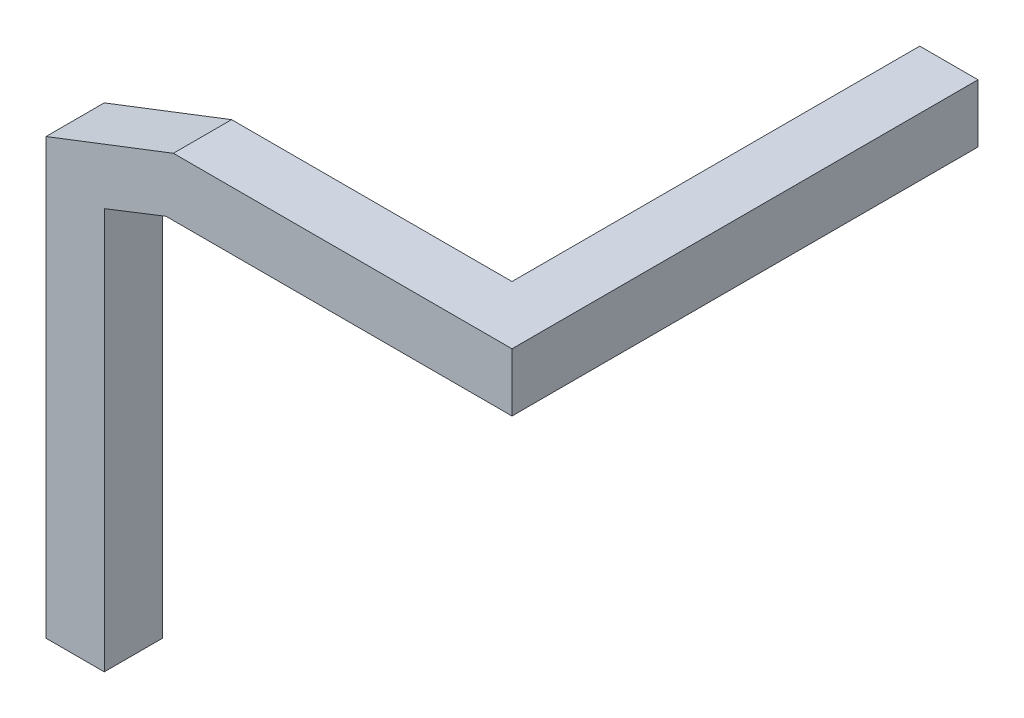
ISO-10303-21;
HEADER;
FILE_DESCRIPTION(('STEP AP214'),'2;1');
FILE_NAME('part.step','',(''),(''),'','','');
FILE_SCHEMA(('AUTOMOTIVE_DESIGN { 1 0 10303 214 1 1 1 1 }'));
ENDSEC;
DATA;
#1=APPLICATION_CONTEXT('core data for automotive mechanical design processes');
#2=APPLICATION_PROTOCOL_DEFINITION('international standard','automotive_design',2000,#1);
#3=PRODUCT_CONTEXT('',#1,'mechanical');
#4=PRODUCT('Part','Part','',(#3));
#5=PRODUCT_RELATED_PRODUCT_CATEGORY('part','',(#4));
#6=PRODUCT_DEFINITION_FORMATION('','',#4);
#7=PRODUCT_DEFINITION_CONTEXT('part definition',#1,'design');
#8=PRODUCT_DEFINITION('design','',#6,#7);
#9=PRODUCT_DEFINITION_SHAPE('','',#8);
#10=(LENGTH_UNIT() NAMED_UNIT(*) SI_UNIT(.MILLI.,.METRE.));
#11=(NAMED_UNIT(*) PLANE_ANGLE_UNIT() SI_UNIT($,.RADIAN.));
#12=(NAMED_UNIT(*) SI_UNIT($,.STERADIAN.) SOLID_ANGLE_UNIT());
#13=UNCERTAINTY_MEASURE_WITH_UNIT(LENGTH_MEASURE(1.E-05),#10,'distance_accuracy_value','');
#14=(GEOMETRIC_REPRESENTATION_CONTEXT(3) GLOBAL_UNCERTAINTY_ASSIGNED_CONTEXT((#13)) GLOBAL_UNIT_ASSIGNED_CONTEXT((#10,
#11,#12)) REPRESENTATION_CONTEXT('',''));
#15=CARTESIAN_POINT('',(0.,0.,0.));
#16=DIRECTION('',(0.,0.,1.));
#17=DIRECTION('',(1.,0.,0.));
#18=AXIS2_PLACEMENT_3D('',#15,#16,#17);
#19=CARTESIAN_POINT('',(0.,0.,800.));
#20=DIRECTION('',(0.,1.,0.));
#21=DIRECTION('',(0.,0.,1.));
#22=AXIS2_PLACEMENT_3D('',#19,#20,#21);
#23=PLANE('',#22);
#24=DIRECTION('',(0.,0.,1.));
#25=VECTOR('',#24,1.);
#26=CARTESIAN_POINT('',(-493.990986431546,0.,700.));
#27=LINE('',#26,#25);
#28=CARTESIAN_POINT('',(-493.990986431546,0.,700.));
#29=VERTEX_POINT('',#28);
#30=CARTESIAN_POINT('',(-493.990986431546,0.,800.));
#31=VERTEX_POINT('',#30);
#32=EDGE_CURVE('E60',#29,#31,#27,.T.);
#33=ORIENTED_EDGE('',*,*,#32,.F.);
#34=DIRECTION('',(1.,0.,0.));
#35=VECTOR('',#34,1.);
#36=CARTESIAN_POINT('',(-700.,0.,700.));
#37=LINE('',#36,#35);
#38=CARTESIAN_POINT('',(0.,0.,700.));
#39=VERTEX_POINT('',#38);
#40=EDGE_CURVE('E132',#29,#39,#37,.T.);
#41=ORIENTED_EDGE('',*,*,#40,.T.);
#42=DIRECTION('',(0.,0.,-1.));
#43=VECTOR('',#42,1.);
#44=CARTESIAN_POINT('',(0.,0.,800.));
#45=LINE('',#44,#43);
#46=CARTESIAN_POINT('',(0.,0.,0.));
#47=VERTEX_POINT('',#46);
#48=EDGE_CURVE('E47',#39,#47,#45,.T.);
#49=ORIENTED_EDGE('',*,*,#48,.T.);
#50=DIRECTION('',(1.,0.,0.));
#51=VECTOR('',#50,1.);
#52=CARTESIAN_POINT('',(0.,0.,0.));
#53=LINE('',#52,#51);
#54=CARTESIAN_POINT('',(100.,0.,0.));
#55=VERTEX_POINT('',#54);
#56=EDGE_CURVE('E212',#47,#55,#53,.T.);
#57=ORIENTED_EDGE('',*,*,#56,.T.);
#58=DIRECTION('',(0.,0.,-1.));
#59=VECTOR('',#58,1.);
#60=CARTESIAN_POINT('',(100.,0.,800.));
#61=LINE('',#60,#59);
#62=CARTESIAN_POINT('',(100.,0.,800.));
#63=VERTEX_POINT('',#62);
#64=EDGE_CURVE('E226',#63,#55,#61,.T.);
#65=ORIENTED_EDGE('',*,*,#64,.F.);
#66=DIRECTION('',(1.,0.,0.));
#67=VECTOR('',#66,1.);
#68=CARTESIAN_POINT('',(0.,0.,800.));
#69=LINE('',#68,#67);
#70=EDGE_CURVE('E197',#31,#63,#69,.T.);
#71=ORIENTED_EDGE('',*,*,#70,.F.);
#72=EDGE_LOOP('',(#33,#41,#49,#57,#65,#71));
#73=FACE_BOUND('',#72,.T.);
#74=ADVANCED_FACE('F43',(#73),#23,.F.);
#75=CARTESIAN_POINT('',(100.,100.,800.));
#76=DIRECTION('',(0.,-1.,0.));
#77=DIRECTION('',(1.,0.,0.));
#78=AXIS2_PLACEMENT_3D('',#75,#76,#77);
#79=PLANE('',#78);
#80=DIRECTION('',(0.,0.,-1.));
#81=VECTOR('',#80,1.);
#82=CARTESIAN_POINT('',(-481.374152595676,100.000000000001,800.));
#83=LINE('',#82,#81);
#84=CARTESIAN_POINT('',(-481.374152595676,100.000000000001,800.));
#85=VERTEX_POINT('',#84);
#86=CARTESIAN_POINT('',(-481.374152595676,100.000000000001,700.));
#87=VERTEX_POINT('',#86);
#88=EDGE_CURVE('E178',#85,#87,#83,.T.);
#89=ORIENTED_EDGE('',*,*,#88,.F.);
#90=DIRECTION('',(-1.,0.,0.));
#91=VECTOR('',#90,1.);
#92=CARTESIAN_POINT('',(100.,100.,800.));
#93=LINE('',#92,#91);
#94=CARTESIAN_POINT('',(100.,100.,800.));
#95=VERTEX_POINT('',#94);
#96=EDGE_CURVE('E204',#95,#85,#93,.T.);
#97=ORIENTED_EDGE('',*,*,#96,.F.);
#98=DIRECTION('',(0.,0.,-1.));
#99=VECTOR('',#98,1.);
#100=CARTESIAN_POINT('',(100.,100.,800.));
#101=LINE('',#100,#99);
#102=CARTESIAN_POINT('',(100.,100.,0.));
#103=VERTEX_POINT('',#102);
#104=EDGE_CURVE('E223',#95,#103,#101,.T.);
#105=ORIENTED_EDGE('',*,*,#104,.T.);
#106=DIRECTION('',(-1.,0.,0.));
#107=VECTOR('',#106,1.);
#108=CARTESIAN_POINT('',(100.,100.,0.));
#109=LINE('',#108,#107);
#110=CARTESIAN_POINT('',(0.,100.,0.));
#111=VERTEX_POINT('',#110);
#112=EDGE_CURVE('E201',#103,#111,#109,.T.);
#113=ORIENTED_EDGE('',*,*,#112,.T.);
#114=DIRECTION('',(0.,0.,-1.));
#115=VECTOR('',#114,1.);
#116=CARTESIAN_POINT('',(0.,100.,800.));
#117=LINE('',#116,#115);
#118=CARTESIAN_POINT('',(0.,100.,700.));
#119=VERTEX_POINT('',#118);
#120=EDGE_CURVE('E208',#119,#111,#117,.T.);
#121=ORIENTED_EDGE('',*,*,#120,.F.);
#122=DIRECTION('',(1.,0.,0.));
#123=VECTOR('',#122,1.);
#124=CARTESIAN_POINT('',(-700.,100.,700.));
#125=LINE('',#124,#123);
#126=EDGE_CURVE('E191',#87,#119,#125,.T.);
#127=ORIENTED_EDGE('',*,*,#126,.F.);
#128=EDGE_LOOP('',(#89,#97,#105,#113,#121,#127));
#129=FACE_BOUND('',#128,.T.);
#130=ADVANCED_FACE('F246',(#129),#79,.F.);
#131=CARTESIAN_POINT('',(0.,0.,800.));
#132=DIRECTION('',(0.,0.,1.));
#133=DIRECTION('',(1.,0.,0.));
#134=AXIS2_PLACEMENT_3D('',#131,#132,#133);
#135=PLANE('',#134);
#136=ORIENTED_EDGE('',*,*,#96,.T.);
#137=DIRECTION('',(0.932941954117874,0.360026818788161,0.));
#138=VECTOR('',#137,1.);
#139=CARTESIAN_POINT('',(-481.374152595676,100.000000000001,800.));
#140=LINE('',#139,#138);
#141=CARTESIAN_POINT('',(-700.,15.6312265747895,800.));
#142=VERTEX_POINT('',#141);
#143=EDGE_CURVE('E170',#142,#85,#140,.T.);
#144=ORIENTED_EDGE('',*,*,#143,.F.);
#145=DIRECTION('',(0.,-1.,0.));
#146=VECTOR('',#145,1.);
#147=CARTESIAN_POINT('',(-700.,0.,800.));
#148=LINE('',#147,#146);
#149=CARTESIAN_POINT('',(-699.999999999999,-730.356100976723,800.));
#150=VERTEX_POINT('',#149);
#151=EDGE_CURVE('E133',#142,#150,#148,.T.);
#152=ORIENTED_EDGE('',*,*,#151,.T.);
#153=DIRECTION('',(1.,0.,0.));
#154=VECTOR('',#153,1.);
#155=CARTESIAN_POINT('',(-699.999999999999,-730.356100976723,800.));
#156=LINE('',#155,#154);
#157=CARTESIAN_POINT('',(-599.999999999999,-730.356100976723,800.));
#158=VERTEX_POINT('',#157);
#159=EDGE_CURVE('E140',#150,#158,#156,.T.);
#160=ORIENTED_EDGE('',*,*,#159,.T.);
#161=DIRECTION('',(0.,1.,0.));
#162=VECTOR('',#161,1.);
#163=CARTESIAN_POINT('',(-599.999999999999,-730.356100976723,800.));
#164=LINE('',#163,#162);
#165=CARTESIAN_POINT('',(-599.999999999999,-41.5645220782218,800.));
#166=VERTEX_POINT('',#165);
#167=EDGE_CURVE('E156',#158,#166,#164,.T.);
#168=ORIENTED_EDGE('',*,*,#167,.T.);
#169=DIRECTION('',(-0.930996002115902,-0.365029374221045,0.));
#170=VECTOR('',#169,1.);
#171=CARTESIAN_POINT('',(-493.990986431546,0.,800.));
#172=LINE('',#171,#170);
#173=EDGE_CURVE('E150',#31,#166,#172,.T.);
#174=ORIENTED_EDGE('',*,*,#173,.F.);
#175=ORIENTED_EDGE('',*,*,#70,.T.);
#176=DIRECTION('',(0.,1.,0.));
#177=VECTOR('',#176,1.);
#178=CARTESIAN_POINT('',(100.,0.,800.));
#179=LINE('',#178,#177);
#180=EDGE_CURVE('E200',#63,#95,#179,.T.);
#181=ORIENTED_EDGE('',*,*,#180,.T.);
#182=EDGE_LOOP('',(#136,#144,#152,#160,#168,#174,#175,#181));
#183=FACE_BOUND('',#182,.T.);
#184=ADVANCED_FACE('F251',(#183),#135,.T.);
#185=CARTESIAN_POINT('',(-700.,100.,700.));
#186=DIRECTION('',(0.,0.,-1.));
#187=DIRECTION('',(-1.,0.,0.));
#188=AXIS2_PLACEMENT_3D('',#185,#186,#187);
#189=PLANE('',#188);
#190=DIRECTION('',(0.,1.,0.));
#191=VECTOR('',#190,1.);
#192=CARTESIAN_POINT('',(-700.,100.,700.));
#193=LINE('',#192,#191);
#194=CARTESIAN_POINT('',(-699.999999999999,-730.356100976723,700.));
#195=VERTEX_POINT('',#194);
#196=CARTESIAN_POINT('',(-700.,15.6312265747895,700.));
#197=VERTEX_POINT('',#196);
#198=EDGE_CURVE('E122',#195,#197,#193,.T.);
#199=ORIENTED_EDGE('',*,*,#198,.T.);
#200=DIRECTION('',(0.932941954117874,0.360026818788161,0.));
#201=VECTOR('',#200,1.);
#202=CARTESIAN_POINT('',(-671.661868457346,26.5670487925273,700.));
#203=LINE('',#202,#201);
#204=EDGE_CURVE('E68',#197,#87,#203,.T.);
#205=ORIENTED_EDGE('',*,*,#204,.T.);
#206=ORIENTED_EDGE('',*,*,#126,.T.);
#207=DIRECTION('',(0.,1.,0.));
#208=VECTOR('',#207,1.);
#209=CARTESIAN_POINT('',(0.,100.,700.));
#210=LINE('',#209,#208);
#211=EDGE_CURVE('E185',#39,#119,#210,.T.);
#212=ORIENTED_EDGE('',*,*,#211,.F.);
#213=ORIENTED_EDGE('',*,*,#40,.F.);
#214=DIRECTION('',(-0.930996002115902,-0.365029374221045,0.));
#215=VECTOR('',#214,1.);
#216=CARTESIAN_POINT('',(-493.990986431546,0.,700.));
#217=LINE('',#216,#215);
#218=CARTESIAN_POINT('',(-599.999999999999,-41.5645220782218,700.));
#219=VERTEX_POINT('',#218);
#220=EDGE_CURVE('E143',#29,#219,#217,.T.);
#221=ORIENTED_EDGE('',*,*,#220,.T.);
#222=DIRECTION('',(0.,1.,0.));
#223=VECTOR('',#222,1.);
#224=CARTESIAN_POINT('',(-599.999999999999,-730.356100976723,700.));
#225=LINE('',#224,#223);
#226=CARTESIAN_POINT('',(-599.999999999999,-730.356100976723,700.));
#227=VERTEX_POINT('',#226);
#228=EDGE_CURVE('E148',#227,#219,#225,.T.);
#229=ORIENTED_EDGE('',*,*,#228,.F.);
#230=DIRECTION('',(1.,0.,0.));
#231=VECTOR('',#230,1.);
#232=CARTESIAN_POINT('',(-699.999999999999,-730.356100976723,700.));
#233=LINE('',#232,#231);
#234=EDGE_CURVE('E138',#195,#227,#233,.T.);
#235=ORIENTED_EDGE('',*,*,#234,.F.);
#236=EDGE_LOOP('',(#199,#205,#206,#212,#213,#221,#229,#235));
#237=FACE_BOUND('',#236,.T.);
#238=ADVANCED_FACE('F146',(#237),#189,.T.);
#239=CARTESIAN_POINT('',(-700.,0.,0.));
#240=DIRECTION('',(-1.,0.,0.));
#241=DIRECTION('',(0.,0.,1.));
#242=AXIS2_PLACEMENT_3D('',#239,#240,#241);
#243=PLANE('',#242);
#244=ORIENTED_EDGE('',*,*,#151,.F.);
#245=DIRECTION('',(0.,0.,-1.));
#246=VECTOR('',#245,1.);
#247=CARTESIAN_POINT('',(-700.,15.6312265747895,800.));
#248=LINE('',#247,#246);
#249=EDGE_CURVE('E128',#142,#197,#248,.T.);
#250=ORIENTED_EDGE('',*,*,#249,.T.);
#251=ORIENTED_EDGE('',*,*,#198,.F.);
#252=DIRECTION('',(0.,0.,1.));
#253=VECTOR('',#252,1.);
#254=CARTESIAN_POINT('',(-699.999999999999,-730.356100976723,700.));
#255=LINE('',#254,#253);
#256=EDGE_CURVE('E126',#195,#150,#255,.T.);
#257=ORIENTED_EDGE('',*,*,#256,.T.);
#258=EDGE_LOOP('',(#244,#250,#251,#257));
#259=FACE_BOUND('',#258,.T.);
#260=ADVANCED_FACE('F125',(#259),#243,.T.);
#261=CARTESIAN_POINT('',(0.,100.,800.));
#262=DIRECTION('',(1.,0.,0.));
#263=DIRECTION('',(0.,1.,0.));
#264=AXIS2_PLACEMENT_3D('',#261,#262,#263);
#265=PLANE('',#264);
#266=ORIENTED_EDGE('',*,*,#48,.F.);
#267=ORIENTED_EDGE('',*,*,#211,.T.);
#268=ORIENTED_EDGE('',*,*,#120,.T.);
#269=DIRECTION('',(0.,-1.,0.));
#270=VECTOR('',#269,1.);
#271=CARTESIAN_POINT('',(0.,100.,0.));
#272=LINE('',#271,#270);
#273=EDGE_CURVE('E194',#111,#47,#272,.T.);
#274=ORIENTED_EDGE('',*,*,#273,.T.);
#275=EDGE_LOOP('',(#266,#267,#268,#274));
#276=FACE_BOUND('',#275,.T.);
#277=ADVANCED_FACE('F45',(#276),#265,.F.);
#278=CARTESIAN_POINT('',(100.,0.,800.));
#279=DIRECTION('',(-1.,0.,0.));
#280=DIRECTION('',(0.,0.,1.));
#281=AXIS2_PLACEMENT_3D('',#278,#279,#280);
#282=PLANE('',#281);
#283=DIRECTION('',(0.,1.,0.));
#284=VECTOR('',#283,1.);
#285=CARTESIAN_POINT('',(100.,0.,0.));
#286=LINE('',#285,#284);
#287=EDGE_CURVE('E215',#55,#103,#286,.T.);
#288=ORIENTED_EDGE('',*,*,#287,.T.);
#289=ORIENTED_EDGE('',*,*,#104,.F.);
#290=ORIENTED_EDGE('',*,*,#180,.F.);
#291=ORIENTED_EDGE('',*,*,#64,.T.);
#292=EDGE_LOOP('',(#288,#289,#290,#291));
#293=FACE_BOUND('',#292,.T.);
#294=ADVANCED_FACE('F249',(#293),#282,.F.);
#295=CARTESIAN_POINT('',(0.,0.,0.));
#296=DIRECTION('',(0.,0.,1.));
#297=DIRECTION('',(1.,0.,0.));
#298=AXIS2_PLACEMENT_3D('',#295,#296,#297);
#299=PLANE('',#298);
#300=ORIENTED_EDGE('',*,*,#273,.F.);
#301=ORIENTED_EDGE('',*,*,#112,.F.);
#302=ORIENTED_EDGE('',*,*,#287,.F.);
#303=ORIENTED_EDGE('',*,*,#56,.F.);
#304=EDGE_LOOP('',(#300,#301,#302,#303));
#305=FACE_BOUND('',#304,.T.);
#306=ADVANCED_FACE('F240',(#305),#299,.F.);
#307=CARTESIAN_POINT('',(-481.374152595676,100.000000000001,800.));
#308=DIRECTION('',(-0.360026818788161,0.932941954117874,0.));
#309=DIRECTION('',(-0.932941954117874,-0.360026818788161,0.));
#310=AXIS2_PLACEMENT_3D('',#307,#308,#309);
#311=PLANE('',#310);
#312=ORIENTED_EDGE('',*,*,#249,.F.);
#313=ORIENTED_EDGE('',*,*,#143,.T.);
#314=ORIENTED_EDGE('',*,*,#88,.T.);
#315=ORIENTED_EDGE('',*,*,#204,.F.);
#316=EDGE_LOOP('',(#312,#313,#314,#315));
#317=FACE_BOUND('',#316,.T.);
#318=ADVANCED_FACE('F258',(#317),#311,.T.);
#319=CARTESIAN_POINT('',(-493.990986431546,0.,700.));
#320=DIRECTION('',(-0.365029374221045,0.930996002115902,0.));
#321=DIRECTION('',(-0.930996002115902,-0.365029374221045,0.));
#322=AXIS2_PLACEMENT_3D('',#319,#320,#321);
#323=PLANE('',#322);
#324=ORIENTED_EDGE('',*,*,#173,.T.);
#325=DIRECTION('',(0.,0.,1.));
#326=VECTOR('',#325,1.);
#327=CARTESIAN_POINT('',(-599.999999999999,-41.5645220782218,700.));
#328=LINE('',#327,#326);
#329=EDGE_CURVE('E171',#219,#166,#328,.T.);
#330=ORIENTED_EDGE('',*,*,#329,.F.);
#331=ORIENTED_EDGE('',*,*,#220,.F.);
#332=ORIENTED_EDGE('',*,*,#32,.T.);
#333=EDGE_LOOP('',(#324,#330,#331,#332));
#334=FACE_BOUND('',#333,.T.);
#335=ADVANCED_FACE('F256',(#334),#323,.F.);
#336=CARTESIAN_POINT('',(-599.999999999999,-730.356100976723,700.));
#337=DIRECTION('',(1.,0.,0.));
#338=DIRECTION('',(0.,1.,0.));
#339=AXIS2_PLACEMENT_3D('',#336,#337,#338);
#340=PLANE('',#339);
#341=ORIENTED_EDGE('',*,*,#167,.F.);
#342=DIRECTION('',(0.,0.,1.));
#343=VECTOR('',#342,1.);
#344=CARTESIAN_POINT('',(-599.999999999999,-730.356100976723,700.));
#345=LINE('',#344,#343);
#346=EDGE_CURVE('E142',#227,#158,#345,.T.);
#347=ORIENTED_EDGE('',*,*,#346,.F.);
#348=ORIENTED_EDGE('',*,*,#228,.T.);
#349=ORIENTED_EDGE('',*,*,#329,.T.);
#350=EDGE_LOOP('',(#341,#347,#348,#349));
#351=FACE_BOUND('',#350,.T.);
#352=ADVANCED_FACE('F261',(#351),#340,.T.);
#353=CARTESIAN_POINT('',(-699.999999999999,-730.356100976723,700.));
#354=DIRECTION('',(0.,-1.,0.));
#355=DIRECTION('',(0.,0.,-1.));
#356=AXIS2_PLACEMENT_3D('',#353,#354,#355);
#357=PLANE('',#356);
#358=CARTESIAN_POINT('',(-649.999999999999,-730.356100976723,750.));
#359=DIRECTION('',(0.,-1.,0.));
#360=DIRECTION('',(0.,0.,-1.));
#361=AXIS2_PLACEMENT_3D('',#358,#359,#360);
#362=CIRCLE('',#361,25.);
#363=CARTESIAN_POINT('',(-649.999999999999,-730.356100976723,725.));
#364=VERTEX_POINT('',#363);
#365=EDGE_CURVE('E11',#364,#364,#362,.T.);
#366=ORIENTED_EDGE('',*,*,#365,.F.);
#367=EDGE_LOOP('',(#366));
#368=FACE_BOUND('',#367,.T.);
#369=ORIENTED_EDGE('',*,*,#159,.F.);
#370=ORIENTED_EDGE('',*,*,#256,.F.);
#371=ORIENTED_EDGE('',*,*,#234,.T.);
#372=ORIENTED_EDGE('',*,*,#346,.T.);
#373=EDGE_LOOP('',(#369,#370,#371,#372));
#374=FACE_BOUND('',#373,.T.);
#375=ADVANCED_FACE('F137',(#368,#374),#357,.T.);
#376=CARTESIAN_POINT('',(-649.999999999999,-755.356100976723,750.));
#377=DIRECTION('',(0.,1.,0.));
#378=DIRECTION('',(0.,0.,1.));
#379=AXIS2_PLACEMENT_3D('',#376,#377,#378);
#380=CYLINDRICAL_SURFACE('',#379,25.);
#381=CARTESIAN_POINT('',(-649.999999999999,-755.356100976723,750.));
#382=DIRECTION('',(0.,-1.,0.));
#383=DIRECTION('',(0.,0.,-1.));
#384=AXIS2_PLACEMENT_3D('',#381,#382,#383);
#385=CIRCLE('',#384,25.);
#386=CARTESIAN_POINT('',(-649.999999999999,-755.356100976723,725.));
#387=VERTEX_POINT('',#386);
#388=EDGE_CURVE('E164',#387,#387,#385,.T.);
#389=ORIENTED_EDGE('',*,*,#388,.F.);
#390=EDGE_LOOP('',(#389));
#391=FACE_BOUND('',#390,.T.);
#392=ORIENTED_EDGE('',*,*,#365,.T.);
#393=EDGE_LOOP('',(#392));
#394=FACE_BOUND('',#393,.T.);
#395=ADVANCED_FACE('F268',(#391,#394),#380,.T.);
#396=CARTESIAN_POINT('',(-649.999999999999,-755.356100976723,750.));
#397=DIRECTION('',(0.,-1.,0.));
#398=DIRECTION('',(0.,0.,-1.));
#399=AXIS2_PLACEMENT_3D('',#396,#397,#398);
#400=PLANE('',#399);
#401=ORIENTED_EDGE('',*,*,#388,.T.);
#402=EDGE_LOOP('',(#401));
#403=FACE_BOUND('',#402,.T.);
#404=ADVANCED_FACE('F371',(#403),#400,.T.);
#405=CLOSED_SHELL('',(#74,#130,#184,#238,#260,#277,#294,#306,#318,#335,#352,#375,#395,#404));
#406=MANIFOLD_SOLID_BREP('B2',#405);
#407=ADVANCED_BREP_SHAPE_REPRESENTATION('',(#18,#406),#14);
#408=SHAPE_DEFINITION_REPRESENTATION(#9,#407);
ENDSEC;
END-ISO-10303-21;
